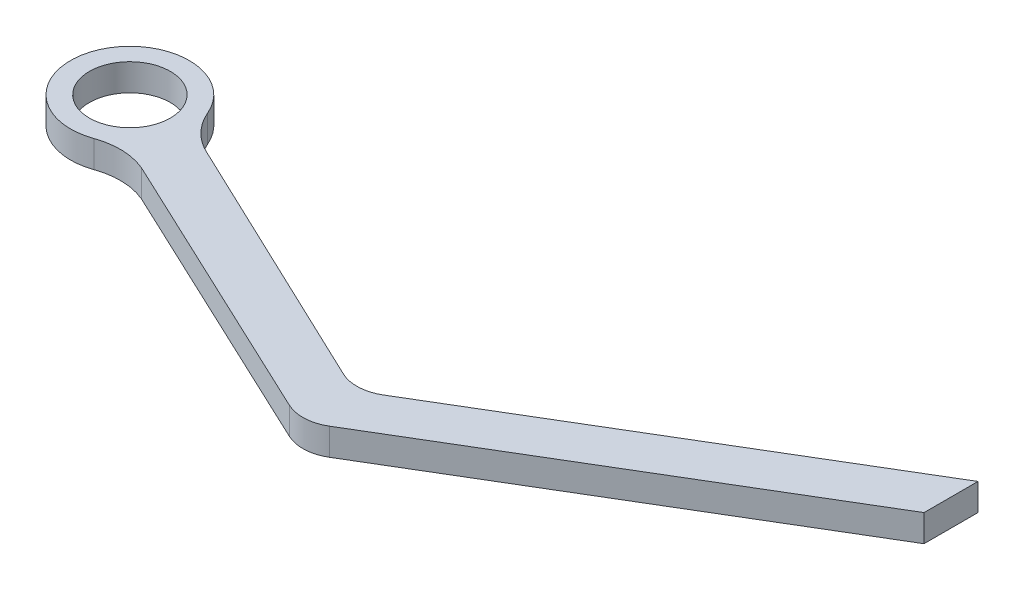
ISO-10303-21;
HEADER;
FILE_DESCRIPTION(('STEP AP214'),'2;1');
FILE_NAME('part.step','',(''),(''),'','','');
FILE_SCHEMA(('AUTOMOTIVE_DESIGN { 1 0 10303 214 1 1 1 1 }'));
ENDSEC;
DATA;
#1=APPLICATION_CONTEXT('core data for automotive mechanical design processes');
#2=APPLICATION_PROTOCOL_DEFINITION('international standard','automotive_design',2000,#1);
#3=PRODUCT_CONTEXT('',#1,'mechanical');
#4=PRODUCT('Part','Part','',(#3));
#5=PRODUCT_RELATED_PRODUCT_CATEGORY('part','',(#4));
#6=PRODUCT_DEFINITION_FORMATION('','',#4);
#7=PRODUCT_DEFINITION_CONTEXT('part definition',#1,'design');
#8=PRODUCT_DEFINITION('design','',#6,#7);
#9=PRODUCT_DEFINITION_SHAPE('','',#8);
#10=(LENGTH_UNIT() NAMED_UNIT(*) SI_UNIT(.MILLI.,.METRE.));
#11=(NAMED_UNIT(*) PLANE_ANGLE_UNIT() SI_UNIT($,.RADIAN.));
#12=(NAMED_UNIT(*) SI_UNIT($,.STERADIAN.) SOLID_ANGLE_UNIT());
#13=UNCERTAINTY_MEASURE_WITH_UNIT(LENGTH_MEASURE(1.E-05),#10,'distance_accuracy_value','');
#14=(GEOMETRIC_REPRESENTATION_CONTEXT(3) GLOBAL_UNCERTAINTY_ASSIGNED_CONTEXT((#13)) GLOBAL_UNIT_ASSIGNED_CONTEXT((#10,
#11,#12)) REPRESENTATION_CONTEXT('',''));
#15=CARTESIAN_POINT('',(0.,0.,0.));
#16=DIRECTION('',(0.,0.,1.));
#17=DIRECTION('',(1.,0.,0.));
#18=AXIS2_PLACEMENT_3D('',#15,#16,#17);
#19=CARTESIAN_POINT('',(0.,2.,0.));
#20=DIRECTION('',(0.,-1.,0.));
#21=DIRECTION('',(0.,0.,-1.));
#22=AXIS2_PLACEMENT_3D('',#19,#20,#21);
#23=CYLINDRICAL_SURFACE('',#22,4.39812850546321);
#24=CARTESIAN_POINT('',(0.,0.,0.));
#25=DIRECTION('',(0.,1.,0.));
#26=DIRECTION('',(0.,0.,1.));
#27=AXIS2_PLACEMENT_3D('',#24,#25,#26);
#28=CIRCLE('',#27,4.39812850546321);
#29=CARTESIAN_POINT('',(4.04626767685698,0.,-1.72373206670599));
#30=VERTEX_POINT('',#29);
#31=CARTESIAN_POINT('',(1.4717553521417,0.,4.14457121232225));
#32=VERTEX_POINT('',#31);
#33=EDGE_CURVE('E147',#30,#32,#28,.T.);
#34=ORIENTED_EDGE('',*,*,#33,.T.);
#35=DIRECTION('',(0.,-1.,0.));
#36=VECTOR('',#35,1.);
#37=CARTESIAN_POINT('',(1.4717553521417,2.,4.14457121232225));
#38=LINE('',#37,#36);
#39=CARTESIAN_POINT('',(1.4717553521417,2.,4.14457121232225));
#40=VERTEX_POINT('',#39);
#41=EDGE_CURVE('E11',#40,#32,#38,.T.);
#42=ORIENTED_EDGE('',*,*,#41,.F.);
#43=CARTESIAN_POINT('',(0.,2.,0.));
#44=DIRECTION('',(0.,1.,0.));
#45=DIRECTION('',(0.,0.,1.));
#46=AXIS2_PLACEMENT_3D('',#43,#44,#45);
#47=CIRCLE('',#46,4.39812850546321);
#48=CARTESIAN_POINT('',(4.04626767685698,2.,-1.72373206670599));
#49=VERTEX_POINT('',#48);
#50=EDGE_CURVE('E212',#49,#40,#47,.T.);
#51=ORIENTED_EDGE('',*,*,#50,.F.);
#52=DIRECTION('',(0.,-1.,0.));
#53=VECTOR('',#52,1.);
#54=CARTESIAN_POINT('',(4.04626767685698,2.,-1.72373206670599));
#55=LINE('',#54,#53);
#56=EDGE_CURVE('E143',#49,#30,#55,.T.);
#57=ORIENTED_EDGE('',*,*,#56,.T.);
#58=EDGE_LOOP('',(#34,#42,#51,#57));
#59=FACE_BOUND('',#58,.T.);
#60=ADVANCED_FACE('F34',(#59),#23,.T.);
#61=CARTESIAN_POINT('',(3.14491627765073,2.,8.85631531799584));
#62=DIRECTION('',(0.,-1.,0.));
#63=DIRECTION('',(0.,0.,-1.));
#64=AXIS2_PLACEMENT_3D('',#61,#62,#63);
#65=CYLINDRICAL_SURFACE('',#64,5.);
#66=CARTESIAN_POINT('',(3.14491627765073,0.,8.85631531799584));
#67=DIRECTION('',(0.,1.,0.));
#68=DIRECTION('',(0.,0.,1.));
#69=AXIS2_PLACEMENT_3D('',#66,#67,#68);
#70=CIRCLE('',#69,5.);
#71=CARTESIAN_POINT('',(5.1151109570444,0.,4.26084657963096));
#72=VERTEX_POINT('',#71);
#73=EDGE_CURVE('E150',#32,#72,#70,.F.);
#74=ORIENTED_EDGE('',*,*,#73,.T.);
#75=DIRECTION('',(0.,-1.,0.));
#76=VECTOR('',#75,1.);
#77=CARTESIAN_POINT('',(5.1151109570444,2.,4.26084657963096));
#78=LINE('',#77,#76);
#79=CARTESIAN_POINT('',(5.1151109570444,2.,4.26084657963096));
#80=VERTEX_POINT('',#79);
#81=EDGE_CURVE('E43',#80,#72,#78,.T.);
#82=ORIENTED_EDGE('',*,*,#81,.F.);
#83=CARTESIAN_POINT('',(3.14491627765073,2.,8.85631531799584));
#84=DIRECTION('',(0.,1.,0.));
#85=DIRECTION('',(0.,0.,1.));
#86=AXIS2_PLACEMENT_3D('',#83,#84,#85);
#87=CIRCLE('',#86,5.);
#88=EDGE_CURVE('E99',#40,#80,#87,.F.);
#89=ORIENTED_EDGE('',*,*,#88,.F.);
#90=ORIENTED_EDGE('',*,*,#41,.T.);
#91=EDGE_LOOP('',(#74,#82,#89,#90));
#92=FACE_BOUND('',#91,.T.);
#93=ADVANCED_FACE('F188',(#92),#65,.F.);
#94=CARTESIAN_POINT('',(-0.713919057817725,2.,1.51621829342861));
#95=DIRECTION('',(-0.425994663308781,0.,0.904725674905072));
#96=DIRECTION('',(0.904725674905072,0.,0.425994663308781));
#97=AXIS2_PLACEMENT_3D('',#94,#95,#96);
#98=PLANE('',#97);
#99=DIRECTION('',(-0.904725674905072,0.,-0.425994663308781));
#100=VECTOR('',#99,1.);
#101=CARTESIAN_POINT('',(-0.713919057817725,0.,1.51621829342861));
#102=LINE('',#101,#100);
#103=CARTESIAN_POINT('',(25.845891994028,0.,14.0220397599886));
#104=VERTEX_POINT('',#103);
#105=EDGE_CURVE('E153',#104,#72,#102,.T.);
#106=ORIENTED_EDGE('',*,*,#105,.F.);
#107=DIRECTION('',(0.,-1.,0.));
#108=VECTOR('',#107,1.);
#109=CARTESIAN_POINT('',(25.845891994028,2.,14.0220397599886));
#110=LINE('',#109,#108);
#111=CARTESIAN_POINT('',(25.845891994028,2.,14.0220397599886));
#112=VERTEX_POINT('',#111);
#113=EDGE_CURVE('E181',#112,#104,#110,.T.);
#114=ORIENTED_EDGE('',*,*,#113,.F.);
#115=DIRECTION('',(-0.904725674905072,0.,-0.425994663308781));
#116=VECTOR('',#115,1.);
#117=CARTESIAN_POINT('',(-0.713919057817725,2.,1.51621829342861));
#118=LINE('',#117,#116);
#119=EDGE_CURVE('E187',#112,#80,#118,.T.);
#120=ORIENTED_EDGE('',*,*,#119,.T.);
#121=ORIENTED_EDGE('',*,*,#81,.T.);
#122=EDGE_LOOP('',(#106,#114,#120,#121));
#123=FACE_BOUND('',#122,.T.);
#124=ADVANCED_FACE('F185',(#123),#98,.T.);
#125=CARTESIAN_POINT('',(27.1238759839543,2.,11.3078627352734));
#126=DIRECTION('',(0.,-1.,0.));
#127=DIRECTION('',(0.,0.,-1.));
#128=AXIS2_PLACEMENT_3D('',#125,#126,#127);
#129=CYLINDRICAL_SURFACE('',#128,3.);
#130=CARTESIAN_POINT('',(27.1238759839543,0.,11.3078627352734));
#131=DIRECTION('',(0.,1.,0.));
#132=DIRECTION('',(0.,0.,1.));
#133=AXIS2_PLACEMENT_3D('',#130,#131,#132);
#134=CIRCLE('',#133,3.);
#135=CARTESIAN_POINT('',(28.6629884262023,0.,13.8829613528253));
#136=VERTEX_POINT('',#135);
#137=EDGE_CURVE('E156',#104,#136,#134,.T.);
#138=ORIENTED_EDGE('',*,*,#137,.T.);
#139=DIRECTION('',(0.,-1.,0.));
#140=VECTOR('',#139,1.);
#141=CARTESIAN_POINT('',(28.6629884262023,2.,13.8829613528253));
#142=LINE('',#141,#140);
#143=CARTESIAN_POINT('',(28.6629884262023,2.,13.8829613528253));
#144=VERTEX_POINT('',#143);
#145=EDGE_CURVE('E178',#144,#136,#142,.T.);
#146=ORIENTED_EDGE('',*,*,#145,.F.);
#147=CARTESIAN_POINT('',(27.1238759839543,2.,11.3078627352734));
#148=DIRECTION('',(0.,1.,0.));
#149=DIRECTION('',(0.,0.,1.));
#150=AXIS2_PLACEMENT_3D('',#147,#148,#149);
#151=CIRCLE('',#150,3.);
#152=EDGE_CURVE('E206',#112,#144,#151,.T.);
#153=ORIENTED_EDGE('',*,*,#152,.F.);
#154=ORIENTED_EDGE('',*,*,#113,.T.);
#155=EDGE_LOOP('',(#138,#146,#153,#154));
#156=FACE_BOUND('',#155,.T.);
#157=ADVANCED_FACE('F198',(#156),#129,.T.);
#158=CARTESIAN_POINT('',(13.6580080036893,2.,22.8512982959485));
#159=DIRECTION('',(-0.513037480749306,0.,-0.85836620585063));
#160=DIRECTION('',(-0.85836620585063,0.,0.513037480749306));
#161=AXIS2_PLACEMENT_3D('',#158,#159,#160);
#162=PLANE('',#161);
#163=DIRECTION('',(0.85836620585063,0.,-0.513037480749306));
#164=VECTOR('',#163,1.);
#165=CARTESIAN_POINT('',(13.6580080036893,0.,22.8512982959485));
#166=LINE('',#165,#164);
#167=CARTESIAN_POINT('',(56.254370384298,0.,-2.60815047530808));
#168=VERTEX_POINT('',#167);
#169=EDGE_CURVE('E158',#136,#168,#166,.T.);
#170=ORIENTED_EDGE('',*,*,#169,.T.);
#171=DIRECTION('',(0.,-1.,0.));
#172=VECTOR('',#171,1.);
#173=CARTESIAN_POINT('',(56.254370384298,2.,-2.60815047530808));
#174=LINE('',#173,#172);
#175=CARTESIAN_POINT('',(56.254370384298,2.,-2.60815047530808));
#176=VERTEX_POINT('',#175);
#177=EDGE_CURVE('E175',#176,#168,#174,.T.);
#178=ORIENTED_EDGE('',*,*,#177,.F.);
#179=DIRECTION('',(0.85836620585063,0.,-0.513037480749306));
#180=VECTOR('',#179,1.);
#181=CARTESIAN_POINT('',(13.6580080036893,2.,22.8512982959485));
#182=LINE('',#181,#180);
#183=EDGE_CURVE('E204',#144,#176,#182,.T.);
#184=ORIENTED_EDGE('',*,*,#183,.F.);
#185=ORIENTED_EDGE('',*,*,#145,.T.);
#186=EDGE_LOOP('',(#170,#178,#184,#185));
#187=FACE_BOUND('',#186,.T.);
#188=ADVANCED_FACE('F202',(#187),#162,.F.);
#189=CARTESIAN_POINT('',(56.254370384298,2.,0.));
#190=DIRECTION('',(-1.,0.,0.));
#191=DIRECTION('',(0.,0.,1.));
#192=AXIS2_PLACEMENT_3D('',#189,#190,#191);
#193=PLANE('',#192);
#194=DIRECTION('',(0.,0.,-1.));
#195=VECTOR('',#194,1.);
#196=CARTESIAN_POINT('',(56.254370384298,0.,0.));
#197=LINE('',#196,#195);
#198=CARTESIAN_POINT('',(56.254370384298,0.,-6.60815047530809));
#199=VERTEX_POINT('',#198);
#200=EDGE_CURVE('E160',#168,#199,#197,.T.);
#201=ORIENTED_EDGE('',*,*,#200,.T.);
#202=DIRECTION('',(0.,-1.,0.));
#203=VECTOR('',#202,1.);
#204=CARTESIAN_POINT('',(56.254370384298,2.,-6.60815047530809));
#205=LINE('',#204,#203);
#206=CARTESIAN_POINT('',(56.254370384298,2.,-6.60815047530809));
#207=VERTEX_POINT('',#206);
#208=EDGE_CURVE('E172',#207,#199,#205,.T.);
#209=ORIENTED_EDGE('',*,*,#208,.F.);
#210=DIRECTION('',(0.,0.,-1.));
#211=VECTOR('',#210,1.);
#212=CARTESIAN_POINT('',(56.254370384298,2.,0.));
#213=LINE('',#212,#211);
#214=EDGE_CURVE('E138',#176,#207,#213,.T.);
#215=ORIENTED_EDGE('',*,*,#214,.F.);
#216=ORIENTED_EDGE('',*,*,#177,.T.);
#217=EDGE_LOOP('',(#201,#209,#215,#216));
#218=FACE_BOUND('',#217,.T.);
#219=ADVANCED_FACE('F242',(#218),#193,.F.);
#220=CARTESIAN_POINT('',(11.8965118604495,2.,19.9041281225629));
#221=DIRECTION('',(0.513037480749306,0.,0.85836620585063));
#222=DIRECTION('',(0.85836620585063,0.,-0.513037480749306));
#223=AXIS2_PLACEMENT_3D('',#220,#221,#222);
#224=PLANE('',#223);
#225=DIRECTION('',(-0.85836620585063,0.,0.513037480749306));
#226=VECTOR('',#225,1.);
#227=CARTESIAN_POINT('',(11.8965118604495,0.,19.9041281225629));
#228=LINE('',#227,#226);
#229=CARTESIAN_POINT('',(28.6685340324081,0.,9.87964679568448));
#230=VERTEX_POINT('',#229);
#231=EDGE_CURVE('E162',#199,#230,#228,.T.);
#232=ORIENTED_EDGE('',*,*,#231,.T.);
#233=DIRECTION('',(0.,-1.,0.));
#234=VECTOR('',#233,1.);
#235=CARTESIAN_POINT('',(28.6685340324081,2.,9.87964679568448));
#236=LINE('',#235,#234);
#237=CARTESIAN_POINT('',(28.6685340324081,2.,9.87964679568448));
#238=VERTEX_POINT('',#237);
#239=EDGE_CURVE('E127',#238,#230,#236,.T.);
#240=ORIENTED_EDGE('',*,*,#239,.F.);
#241=DIRECTION('',(-0.85836620585063,0.,0.513037480749306));
#242=VECTOR('',#241,1.);
#243=CARTESIAN_POINT('',(11.8965118604495,2.,19.9041281225629));
#244=LINE('',#243,#242);
#245=EDGE_CURVE('E135',#207,#238,#244,.T.);
#246=ORIENTED_EDGE('',*,*,#245,.F.);
#247=ORIENTED_EDGE('',*,*,#208,.T.);
#248=EDGE_LOOP('',(#232,#240,#246,#247));
#249=FACE_BOUND('',#248,.T.);
#250=ADVANCED_FACE('F245',(#249),#224,.F.);
#251=CARTESIAN_POINT('',(27.1294215901601,2.,7.30454817813259));
#252=DIRECTION('',(0.,-1.,0.));
#253=DIRECTION('',(0.,0.,-1.));
#254=AXIS2_PLACEMENT_3D('',#251,#252,#253);
#255=CYLINDRICAL_SURFACE('',#254,3.);
#256=CARTESIAN_POINT('',(27.1294215901601,0.,7.30454817813259));
#257=DIRECTION('',(0.,1.,0.));
#258=DIRECTION('',(0.,0.,1.));
#259=AXIS2_PLACEMENT_3D('',#256,#257,#258);
#260=CIRCLE('',#259,3.);
#261=CARTESIAN_POINT('',(25.8423460389882,0.,10.0144257631123));
#262=VERTEX_POINT('',#261);
#263=EDGE_CURVE('E126',#262,#230,#260,.T.);
#264=ORIENTED_EDGE('',*,*,#263,.F.);
#265=DIRECTION('',(0.,-1.,0.));
#266=VECTOR('',#265,1.);
#267=CARTESIAN_POINT('',(25.8423460389882,2.,10.0144257631123));
#268=LINE('',#267,#266);
#269=CARTESIAN_POINT('',(25.8423460389882,2.,10.0144257631123));
#270=VERTEX_POINT('',#269);
#271=EDGE_CURVE('E120',#270,#262,#268,.T.);
#272=ORIENTED_EDGE('',*,*,#271,.F.);
#273=CARTESIAN_POINT('',(27.1294215901601,2.,7.30454817813259));
#274=DIRECTION('',(0.,1.,0.));
#275=DIRECTION('',(0.,0.,1.));
#276=AXIS2_PLACEMENT_3D('',#273,#274,#275);
#277=CIRCLE('',#276,3.);
#278=EDGE_CURVE('E124',#270,#238,#277,.T.);
#279=ORIENTED_EDGE('',*,*,#278,.T.);
#280=ORIENTED_EDGE('',*,*,#239,.T.);
#281=EDGE_LOOP('',(#264,#272,#279,#280));
#282=FACE_BOUND('',#281,.T.);
#283=ADVANCED_FACE('F122',(#282),#255,.F.);
#284=CARTESIAN_POINT('',(0.875666694906445,2.,-1.84367541305521));
#285=DIRECTION('',(-0.429025183723988,0.,0.903292528326565));
#286=DIRECTION('',(0.903292528326565,0.,0.429025183723988));
#287=AXIS2_PLACEMENT_3D('',#284,#285,#286);
#288=PLANE('',#287);
#289=DIRECTION('',(-0.903292528326565,0.,-0.429025183723988));
#290=VECTOR('',#289,1.);
#291=CARTESIAN_POINT('',(0.875666694906445,0.,-1.84367541305521));
#292=LINE('',#291,#290);
#293=CARTESIAN_POINT('',(6.69366642565293,0.,0.919624763924917));
#294=VERTEX_POINT('',#293);
#295=EDGE_CURVE('E85',#262,#294,#292,.T.);
#296=ORIENTED_EDGE('',*,*,#295,.T.);
#297=DIRECTION('',(0.,-1.,0.));
#298=VECTOR('',#297,1.);
#299=CARTESIAN_POINT('',(6.69366642565293,2.,0.919624763924917));
#300=LINE('',#299,#298);
#301=CARTESIAN_POINT('',(6.69366642565293,2.,0.919624763924917));
#302=VERTEX_POINT('',#301);
#303=EDGE_CURVE('E128',#302,#294,#300,.T.);
#304=ORIENTED_EDGE('',*,*,#303,.F.);
#305=DIRECTION('',(-0.903292528326565,0.,-0.429025183723988));
#306=VECTOR('',#305,1.);
#307=CARTESIAN_POINT('',(0.875666694906445,2.,-1.84367541305521));
#308=LINE('',#307,#306);
#309=EDGE_CURVE('E130',#270,#302,#308,.T.);
#310=ORIENTED_EDGE('',*,*,#309,.F.);
#311=ORIENTED_EDGE('',*,*,#271,.T.);
#312=EDGE_LOOP('',(#296,#304,#310,#311));
#313=FACE_BOUND('',#312,.T.);
#314=ADVANCED_FACE('F131',(#313),#288,.F.);
#315=CARTESIAN_POINT('',(0.,2.,0.));
#316=DIRECTION('',(0.,-1.,0.));
#317=DIRECTION('',(0.,0.,-1.));
#318=AXIS2_PLACEMENT_3D('',#315,#316,#317);
#319=CYLINDRICAL_SURFACE('',#318,3.);
#320=CARTESIAN_POINT('',(0.,2.,0.));
#321=DIRECTION('',(0.,1.,0.));
#322=DIRECTION('',(0.,0.,1.));
#323=AXIS2_PLACEMENT_3D('',#320,#321,#322);
#324=CIRCLE('',#323,3.);
#325=CARTESIAN_POINT('',(0.,2.,3.));
#326=VERTEX_POINT('',#325);
#327=EDGE_CURVE('E168',#326,#326,#324,.T.);
#328=ORIENTED_EDGE('',*,*,#327,.T.);
#329=EDGE_LOOP('',(#328));
#330=FACE_BOUND('',#329,.T.);
#331=CARTESIAN_POINT('',(0.,0.,0.));
#332=DIRECTION('',(0.,1.,0.));
#333=DIRECTION('',(0.,0.,1.));
#334=AXIS2_PLACEMENT_3D('',#331,#332,#333);
#335=CIRCLE('',#334,3.);
#336=CARTESIAN_POINT('',(0.,0.,3.));
#337=VERTEX_POINT('',#336);
#338=EDGE_CURVE('E144',#337,#337,#335,.T.);
#339=ORIENTED_EDGE('',*,*,#338,.F.);
#340=EDGE_LOOP('',(#339));
#341=FACE_BOUND('',#340,.T.);
#342=ADVANCED_FACE('F36',(#330,#341),#319,.F.);
#343=CARTESIAN_POINT('',(8.64625568520057,2.,-3.68335201023973));
#344=DIRECTION('',(0.,-1.,0.));
#345=DIRECTION('',(0.,0.,-1.));
#346=AXIS2_PLACEMENT_3D('',#343,#344,#345);
#347=CYLINDRICAL_SURFACE('',#346,5.);
#348=CARTESIAN_POINT('',(8.64625568520057,0.,-3.68335201023973));
#349=DIRECTION('',(0.,1.,0.));
#350=DIRECTION('',(0.,0.,1.));
#351=AXIS2_PLACEMENT_3D('',#348,#349,#350);
#352=CIRCLE('',#351,5.);
#353=EDGE_CURVE('E91',#294,#30,#352,.F.);
#354=ORIENTED_EDGE('',*,*,#353,.T.);
#355=ORIENTED_EDGE('',*,*,#56,.F.);
#356=CARTESIAN_POINT('',(8.64625568520057,2.,-3.68335201023973));
#357=DIRECTION('',(0.,1.,0.));
#358=DIRECTION('',(0.,0.,1.));
#359=AXIS2_PLACEMENT_3D('',#356,#357,#358);
#360=CIRCLE('',#359,5.);
#361=EDGE_CURVE('E51',#302,#49,#360,.F.);
#362=ORIENTED_EDGE('',*,*,#361,.F.);
#363=ORIENTED_EDGE('',*,*,#303,.T.);
#364=EDGE_LOOP('',(#354,#355,#362,#363));
#365=FACE_BOUND('',#364,.T.);
#366=ADVANCED_FACE('F220',(#365),#347,.F.);
#367=CARTESIAN_POINT('',(0.,2.,0.));
#368=DIRECTION('',(0.,1.,0.));
#369=DIRECTION('',(0.,0.,1.));
#370=AXIS2_PLACEMENT_3D('',#367,#368,#369);
#371=PLANE('',#370);
#372=ORIENTED_EDGE('',*,*,#327,.F.);
#373=EDGE_LOOP('',(#372));
#374=FACE_BOUND('',#373,.T.);
#375=ORIENTED_EDGE('',*,*,#50,.T.);
#376=ORIENTED_EDGE('',*,*,#88,.T.);
#377=ORIENTED_EDGE('',*,*,#119,.F.);
#378=ORIENTED_EDGE('',*,*,#152,.T.);
#379=ORIENTED_EDGE('',*,*,#183,.T.);
#380=ORIENTED_EDGE('',*,*,#214,.T.);
#381=ORIENTED_EDGE('',*,*,#245,.T.);
#382=ORIENTED_EDGE('',*,*,#278,.F.);
#383=ORIENTED_EDGE('',*,*,#309,.T.);
#384=ORIENTED_EDGE('',*,*,#361,.T.);
#385=EDGE_LOOP('',(#375,#376,#377,#378,#379,#380,#381,#382,#383,#384));
#386=FACE_BOUND('',#385,.T.);
#387=ADVANCED_FACE('F133',(#374,#386),#371,.T.);
#388=CARTESIAN_POINT('',(0.,0.,0.));
#389=DIRECTION('',(0.,1.,0.));
#390=DIRECTION('',(0.,0.,1.));
#391=AXIS2_PLACEMENT_3D('',#388,#389,#390);
#392=PLANE('',#391);
#393=ORIENTED_EDGE('',*,*,#338,.T.);
#394=EDGE_LOOP('',(#393));
#395=FACE_BOUND('',#394,.T.);
#396=ORIENTED_EDGE('',*,*,#33,.F.);
#397=ORIENTED_EDGE('',*,*,#353,.F.);
#398=ORIENTED_EDGE('',*,*,#295,.F.);
#399=ORIENTED_EDGE('',*,*,#263,.T.);
#400=ORIENTED_EDGE('',*,*,#231,.F.);
#401=ORIENTED_EDGE('',*,*,#200,.F.);
#402=ORIENTED_EDGE('',*,*,#169,.F.);
#403=ORIENTED_EDGE('',*,*,#137,.F.);
#404=ORIENTED_EDGE('',*,*,#105,.T.);
#405=ORIENTED_EDGE('',*,*,#73,.F.);
#406=EDGE_LOOP('',(#396,#397,#398,#399,#400,#401,#402,#403,#404,#405));
#407=FACE_BOUND('',#406,.T.);
#408=ADVANCED_FACE('F193',(#395,#407),#392,.F.);
#409=CLOSED_SHELL('',(#60,#93,#124,#157,#188,#219,#250,#283,#314,#342,#366,#387,#408));
#410=MANIFOLD_SOLID_BREP('B2',#409);
#411=ADVANCED_BREP_SHAPE_REPRESENTATION('',(#18,#410),#14);
#412=SHAPE_DEFINITION_REPRESENTATION(#9,#411);
ENDSEC;
END-ISO-10303-21;
